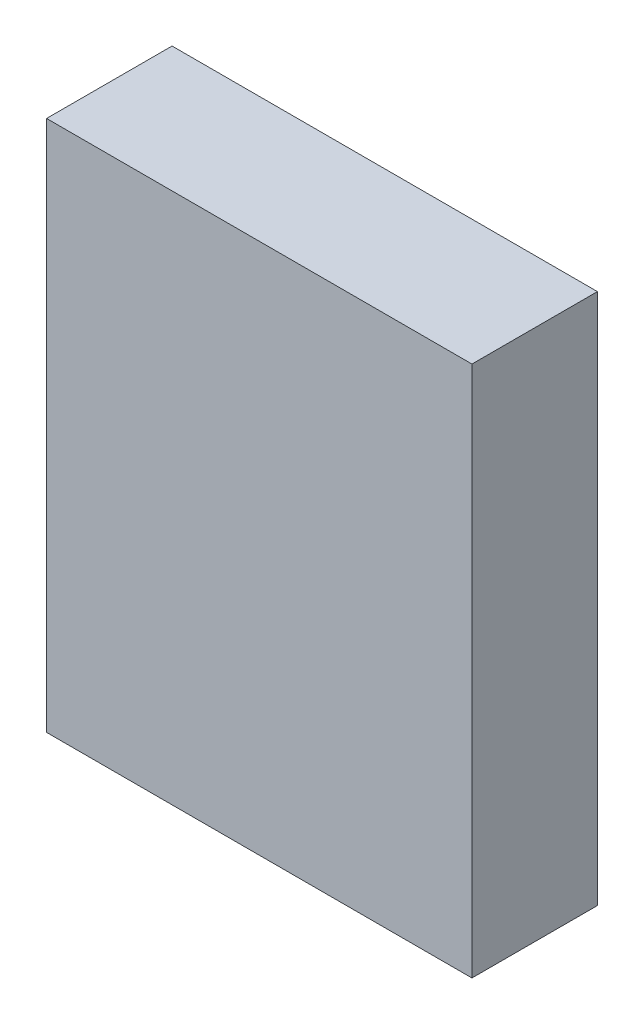
ISO-10303-21;
HEADER;
FILE_DESCRIPTION(('STEP AP214'),'2;1');
FILE_NAME('part.step','',(''),(''),'','','');
FILE_SCHEMA(('AUTOMOTIVE_DESIGN { 1 0 10303 214 1 1 1 1 }'));
ENDSEC;
DATA;
#1=APPLICATION_CONTEXT('core data for automotive mechanical design processes');
#2=APPLICATION_PROTOCOL_DEFINITION('international standard','automotive_design',2000,#1);
#3=PRODUCT_CONTEXT('',#1,'mechanical');
#4=PRODUCT('Part','Part','',(#3));
#5=PRODUCT_RELATED_PRODUCT_CATEGORY('part','',(#4));
#6=PRODUCT_DEFINITION_FORMATION('','',#4);
#7=PRODUCT_DEFINITION_CONTEXT('part definition',#1,'design');
#8=PRODUCT_DEFINITION('design','',#6,#7);
#9=PRODUCT_DEFINITION_SHAPE('','',#8);
#10=(LENGTH_UNIT() NAMED_UNIT(*) SI_UNIT(.MILLI.,.METRE.));
#11=(NAMED_UNIT(*) PLANE_ANGLE_UNIT() SI_UNIT($,.RADIAN.));
#12=(NAMED_UNIT(*) SI_UNIT($,.STERADIAN.) SOLID_ANGLE_UNIT());
#13=UNCERTAINTY_MEASURE_WITH_UNIT(LENGTH_MEASURE(1.E-05),#10,'distance_accuracy_value','');
#14=(GEOMETRIC_REPRESENTATION_CONTEXT(3) GLOBAL_UNCERTAINTY_ASSIGNED_CONTEXT((#13)) GLOBAL_UNIT_ASSIGNED_CONTEXT((#10,
#11,#12)) REPRESENTATION_CONTEXT('',''));
#15=CARTESIAN_POINT('',(0.,0.,0.));
#16=DIRECTION('',(0.,0.,1.));
#17=DIRECTION('',(1.,0.,0.));
#18=AXIS2_PLACEMENT_3D('',#15,#16,#17);
#19=CARTESIAN_POINT('',(-0.499999,-0.62500002,0.29499814));
#20=DIRECTION('',(0.,0.,1.));
#21=DIRECTION('',(1.,0.,0.));
#22=AXIS2_PLACEMENT_3D('',#19,#20,#21);
#23=PLANE('',#22);
#24=DIRECTION('',(1.,0.,0.));
#25=VECTOR('',#24,1.);
#26=CARTESIAN_POINT('',(-0.499999,0.62500002,0.29499814));
#27=LINE('',#26,#25);
#28=CARTESIAN_POINT('',(-0.499999,0.62500002,0.29499814));
#29=VERTEX_POINT('',#28);
#30=CARTESIAN_POINT('',(0.50000154,0.62500002,0.29499814));
#31=VERTEX_POINT('',#30);
#32=EDGE_CURVE('E52',#29,#31,#27,.T.);
#33=ORIENTED_EDGE('',*,*,#32,.F.);
#34=DIRECTION('',(0.,1.,0.));
#35=VECTOR('',#34,1.);
#36=CARTESIAN_POINT('',(-0.499999,-0.62500002,0.29499814));
#37=LINE('',#36,#35);
#38=CARTESIAN_POINT('',(-0.499999,-0.62500002,0.29499814));
#39=VERTEX_POINT('',#38);
#40=EDGE_CURVE('E67',#39,#29,#37,.T.);
#41=ORIENTED_EDGE('',*,*,#40,.F.);
#42=DIRECTION('',(1.,0.,0.));
#43=VECTOR('',#42,1.);
#44=CARTESIAN_POINT('',(0.50000154,-0.62500002,0.29499814));
#45=LINE('',#44,#43);
#46=CARTESIAN_POINT('',(0.50000154,-0.62500002,0.29499814));
#47=VERTEX_POINT('',#46);
#48=EDGE_CURVE('E19',#47,#39,#45,.F.);
#49=ORIENTED_EDGE('',*,*,#48,.F.);
#50=DIRECTION('',(0.,1.,0.));
#51=VECTOR('',#50,1.);
#52=CARTESIAN_POINT('',(0.50000154,0.62500002,0.29499814));
#53=LINE('',#52,#51);
#54=EDGE_CURVE('E57',#31,#47,#53,.F.);
#55=ORIENTED_EDGE('',*,*,#54,.F.);
#56=EDGE_LOOP('',(#33,#41,#49,#55));
#57=FACE_BOUND('',#56,.T.);
#58=ADVANCED_FACE('F16',(#57),#23,.T.);
#59=CARTESIAN_POINT('',(0.50000154,-0.62500002,0.));
#60=DIRECTION('',(0.,-1.,0.));
#61=DIRECTION('',(0.,0.,-1.));
#62=AXIS2_PLACEMENT_3D('',#59,#60,#61);
#63=PLANE('',#62);
#64=DIRECTION('',(0.,0.,1.));
#65=VECTOR('',#64,1.);
#66=CARTESIAN_POINT('',(-0.499999,-0.62500002,0.));
#67=LINE('',#66,#65);
#68=CARTESIAN_POINT('',(-0.499999,-0.62500002,0.));
#69=VERTEX_POINT('',#68);
#70=EDGE_CURVE('E78',#69,#39,#67,.T.);
#71=ORIENTED_EDGE('',*,*,#70,.F.);
#72=DIRECTION('',(1.,0.,0.));
#73=VECTOR('',#72,1.);
#74=CARTESIAN_POINT('',(-0.499999,-0.62500002,0.));
#75=LINE('',#74,#73);
#76=CARTESIAN_POINT('',(0.50000154,-0.62500002,0.));
#77=VERTEX_POINT('',#76);
#78=EDGE_CURVE('E73',#69,#77,#75,.T.);
#79=ORIENTED_EDGE('',*,*,#78,.T.);
#80=DIRECTION('',(0.,0.,-1.));
#81=VECTOR('',#80,1.);
#82=CARTESIAN_POINT('',(0.50000154,-0.62500002,0.));
#83=LINE('',#82,#81);
#84=EDGE_CURVE('E62',#47,#77,#83,.T.);
#85=ORIENTED_EDGE('',*,*,#84,.F.);
#86=ORIENTED_EDGE('',*,*,#48,.T.);
#87=EDGE_LOOP('',(#71,#79,#85,#86));
#88=FACE_BOUND('',#87,.T.);
#89=ADVANCED_FACE('F72',(#88),#63,.T.);
#90=CARTESIAN_POINT('',(0.50000154,0.62500002,0.));
#91=DIRECTION('',(1.,0.,0.));
#92=DIRECTION('',(0.,0.,-1.));
#93=AXIS2_PLACEMENT_3D('',#90,#91,#92);
#94=PLANE('',#93);
#95=ORIENTED_EDGE('',*,*,#84,.T.);
#96=DIRECTION('',(0.,1.,0.));
#97=VECTOR('',#96,1.);
#98=CARTESIAN_POINT('',(0.50000154,-0.62500002,0.));
#99=LINE('',#98,#97);
#100=CARTESIAN_POINT('',(0.50000154,0.62500002,0.));
#101=VERTEX_POINT('',#100);
#102=EDGE_CURVE('E83',#77,#101,#99,.T.);
#103=ORIENTED_EDGE('',*,*,#102,.T.);
#104=DIRECTION('',(0.,0.,1.));
#105=VECTOR('',#104,1.);
#106=CARTESIAN_POINT('',(0.50000154,0.62500002,0.));
#107=LINE('',#106,#105);
#108=EDGE_CURVE('E64',#31,#101,#107,.F.);
#109=ORIENTED_EDGE('',*,*,#108,.F.);
#110=ORIENTED_EDGE('',*,*,#54,.T.);
#111=EDGE_LOOP('',(#95,#103,#109,#110));
#112=FACE_BOUND('',#111,.T.);
#113=ADVANCED_FACE('F59',(#112),#94,.T.);
#114=CARTESIAN_POINT('',(-0.499999,0.62500002,0.));
#115=DIRECTION('',(0.,1.,0.));
#116=DIRECTION('',(0.,0.,1.));
#117=AXIS2_PLACEMENT_3D('',#114,#115,#116);
#118=PLANE('',#117);
#119=ORIENTED_EDGE('',*,*,#108,.T.);
#120=DIRECTION('',(1.,0.,0.));
#121=VECTOR('',#120,1.);
#122=CARTESIAN_POINT('',(-0.499999,0.62500002,0.));
#123=LINE('',#122,#121);
#124=CARTESIAN_POINT('',(-0.499999,0.62500002,0.));
#125=VERTEX_POINT('',#124);
#126=EDGE_CURVE('E25',#101,#125,#123,.F.);
#127=ORIENTED_EDGE('',*,*,#126,.T.);
#128=DIRECTION('',(0.,0.,1.));
#129=VECTOR('',#128,1.);
#130=CARTESIAN_POINT('',(-0.499999,0.62500002,0.));
#131=LINE('',#130,#129);
#132=EDGE_CURVE('E33',#29,#125,#131,.F.);
#133=ORIENTED_EDGE('',*,*,#132,.F.);
#134=ORIENTED_EDGE('',*,*,#32,.T.);
#135=EDGE_LOOP('',(#119,#127,#133,#134));
#136=FACE_BOUND('',#135,.T.);
#137=ADVANCED_FACE('F87',(#136),#118,.T.);
#138=CARTESIAN_POINT('',(-0.499999,-0.62500002,0.));
#139=DIRECTION('',(-1.,0.,0.));
#140=DIRECTION('',(0.,0.,1.));
#141=AXIS2_PLACEMENT_3D('',#138,#139,#140);
#142=PLANE('',#141);
#143=ORIENTED_EDGE('',*,*,#132,.T.);
#144=DIRECTION('',(0.,1.,0.));
#145=VECTOR('',#144,1.);
#146=CARTESIAN_POINT('',(-0.499999,-0.62500002,0.));
#147=LINE('',#146,#145);
#148=EDGE_CURVE('E11',#125,#69,#147,.F.);
#149=ORIENTED_EDGE('',*,*,#148,.T.);
#150=ORIENTED_EDGE('',*,*,#70,.T.);
#151=ORIENTED_EDGE('',*,*,#40,.T.);
#152=EDGE_LOOP('',(#143,#149,#150,#151));
#153=FACE_BOUND('',#152,.T.);
#154=ADVANCED_FACE('F90',(#153),#142,.T.);
#155=CARTESIAN_POINT('',(-0.499999,-0.62500002,0.));
#156=DIRECTION('',(0.,0.,1.));
#157=DIRECTION('',(1.,0.,0.));
#158=AXIS2_PLACEMENT_3D('',#155,#156,#157);
#159=PLANE('',#158);
#160=ORIENTED_EDGE('',*,*,#126,.F.);
#161=ORIENTED_EDGE('',*,*,#102,.F.);
#162=ORIENTED_EDGE('',*,*,#78,.F.);
#163=ORIENTED_EDGE('',*,*,#148,.F.);
#164=EDGE_LOOP('',(#160,#161,#162,#163));
#165=FACE_BOUND('',#164,.T.);
#166=ADVANCED_FACE('F89',(#165),#159,.F.);
#167=CLOSED_SHELL('',(#58,#89,#113,#137,#154,#166));
#168=MANIFOLD_SOLID_BREP('B1',#167);
#169=ADVANCED_BREP_SHAPE_REPRESENTATION('',(#18,#168),#14);
#170=SHAPE_DEFINITION_REPRESENTATION(#9,#169);
ENDSEC;
END-ISO-10303-21;
